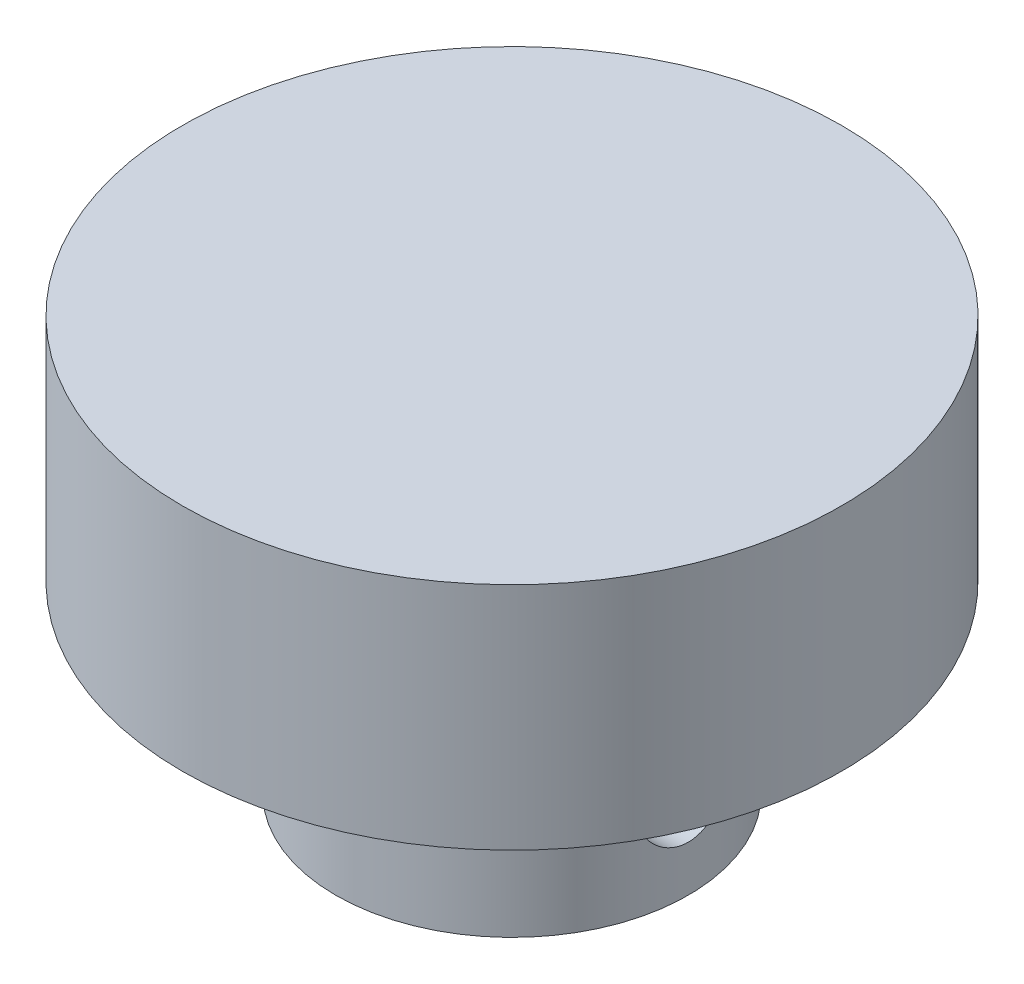
ISO-10303-21;
HEADER;
FILE_DESCRIPTION(('STEP AP214'),'2;1');
FILE_NAME('part.step','',(''),(''),'','','');
FILE_SCHEMA(('AUTOMOTIVE_DESIGN { 1 0 10303 214 1 1 1 1 }'));
ENDSEC;
DATA;
#1=APPLICATION_CONTEXT('core data for automotive mechanical design processes');
#2=APPLICATION_PROTOCOL_DEFINITION('international standard','automotive_design',2000,#1);
#3=PRODUCT_CONTEXT('',#1,'mechanical');
#4=PRODUCT('Part','Part','',(#3));
#5=PRODUCT_RELATED_PRODUCT_CATEGORY('part','',(#4));
#6=PRODUCT_DEFINITION_FORMATION('','',#4);
#7=PRODUCT_DEFINITION_CONTEXT('part definition',#1,'design');
#8=PRODUCT_DEFINITION('design','',#6,#7);
#9=PRODUCT_DEFINITION_SHAPE('','',#8);
#10=(LENGTH_UNIT() NAMED_UNIT(*) SI_UNIT(.MILLI.,.METRE.));
#11=(NAMED_UNIT(*) PLANE_ANGLE_UNIT() SI_UNIT($,.RADIAN.));
#12=(NAMED_UNIT(*) SI_UNIT($,.STERADIAN.) SOLID_ANGLE_UNIT());
#13=UNCERTAINTY_MEASURE_WITH_UNIT(LENGTH_MEASURE(1.E-05),#10,'distance_accuracy_value','');
#14=(GEOMETRIC_REPRESENTATION_CONTEXT(3) GLOBAL_UNCERTAINTY_ASSIGNED_CONTEXT((#13)) GLOBAL_UNIT_ASSIGNED_CONTEXT((#10,
#11,#12)) REPRESENTATION_CONTEXT('',''));
#15=CARTESIAN_POINT('',(0.,0.,0.));
#16=DIRECTION('',(0.,0.,1.));
#17=DIRECTION('',(1.,0.,0.));
#18=AXIS2_PLACEMENT_3D('',#15,#16,#17);
#19=CARTESIAN_POINT('',(0.,0.,0.));
#20=DIRECTION('',(0.,-1.,0.));
#21=DIRECTION('',(0.,0.,-1.));
#22=AXIS2_PLACEMENT_3D('',#19,#20,#21);
#23=CYLINDRICAL_SURFACE('',#22,2.);
#24=CARTESIAN_POINT('',(0.,-27.,0.));
#25=DIRECTION('',(0.,-1.,0.));
#26=DIRECTION('',(0.,0.,-1.));
#27=AXIS2_PLACEMENT_3D('',#24,#25,#26);
#28=CIRCLE('',#27,2.);
#29=CARTESIAN_POINT('',(0.,-27.,-2.));
#30=VERTEX_POINT('',#29);
#31=EDGE_CURVE('E55',#30,#30,#28,.T.);
#32=ORIENTED_EDGE('',*,*,#31,.T.);
#33=EDGE_LOOP('',(#32));
#34=FACE_BOUND('',#33,.T.);
#35=CARTESIAN_POINT('',(0.,-23.2360679774998,-2.));
#36=CARTESIAN_POINT('',(-0.0976283108686207,-23.2360775346282,-1.99999453997731));
#37=CARTESIAN_POINT('',(-0.195290753708801,-23.2425807104744,-1.99278992503664));
#38=CARTESIAN_POINT('',(-0.387119911650814,-23.2673197250162,-1.96458268317731));
#39=CARTESIAN_POINT('',(-0.481280035529566,-23.2855766081271,-1.94355530587862));
#40=CARTESIAN_POINT('',(-0.662735441877684,-23.3305658582557,-1.88935861676632));
#41=CARTESIAN_POINT('',(-0.750087696737658,-23.357215617946,-1.85630718014214));
#42=CARTESIAN_POINT('',(-0.917865832346665,-23.4158409468183,-1.77934008393538));
#43=CARTESIAN_POINT('',(-0.998290269976474,-23.4478176215883,-1.73542216812163));
#44=CARTESIAN_POINT('',(-1.16364688761691,-23.5194607293203,-1.63002410007714));
#45=CARTESIAN_POINT('',(-1.2473321177172,-23.5595493609036,-1.56687435451732));
#46=CARTESIAN_POINT('',(-1.40400270887428,-23.6394482730808,-1.4281921974068));
#47=CARTESIAN_POINT('',(-1.47697752165853,-23.6792582429799,-1.3526477317708));
#48=CARTESIAN_POINT('',(-1.62064365878166,-23.7608881852375,-1.17815690494295));
#49=CARTESIAN_POINT('',(-1.68948251177567,-23.8021678584692,-1.07740643965819));
#50=CARTESIAN_POINT('',(-1.80864209549007,-23.8755848448276,-0.862470964212231));
#51=CARTESIAN_POINT('',(-1.85898351403119,-23.9077323623104,-0.748301152321702));
#52=CARTESIAN_POINT('',(-1.93355640101745,-23.9559990746473,-0.523249073480001));
#53=CARTESIAN_POINT('',(-1.96008334449556,-23.9735117561587,-0.413434725181415));
#54=CARTESIAN_POINT('',(-1.99418448928365,-23.9960974546192,-0.189695448729861));
#55=CARTESIAN_POINT('',(-2.00178255922544,-24.0011861376236,-0.0757758812858242));
#56=CARTESIAN_POINT('',(-1.99782755005095,-23.9985536172295,0.13414705023233));
#57=CARTESIAN_POINT('',(-1.98901094868294,-23.9926626491013,0.230240638008753));
#58=CARTESIAN_POINT('',(-1.95790894864109,-23.9720818279002,0.419238633271016));
#59=CARTESIAN_POINT('',(-1.93562256769646,-23.957391333131,0.512142807649725));
#60=CARTESIAN_POINT('',(-1.87880431520542,-23.9205209170374,0.692077937671169));
#61=CARTESIAN_POINT('',(-1.84432111480144,-23.8983707798268,0.779130623845962));
#62=CARTESIAN_POINT('',(-1.76444635704718,-23.8482110447629,0.946209150653556));
#63=CARTESIAN_POINT('',(-1.71905280849849,-23.8202003774516,1.0262337049694));
#64=CARTESIAN_POINT('',(-1.61202126254011,-23.756180584507,1.18828429196344));
#65=CARTESIAN_POINT('',(-1.54903247664721,-23.7196040879203,1.26919148099708));
#66=CARTESIAN_POINT('',(-1.41210132051968,-23.64400601827,1.41998807498305));
#67=CARTESIAN_POINT('',(-1.33814205406619,-23.6049807281523,1.48986013519457));
#68=CARTESIAN_POINT('',(-1.16803678978671,-23.5215004494415,1.62772235326165));
#69=CARTESIAN_POINT('',(-1.07022892028551,-23.4771432000893,1.69373593126354));
#70=CARTESIAN_POINT('',(-0.862490160779287,-23.394756108311,1.80834874945482));
#71=CARTESIAN_POINT('',(-0.752580005586102,-23.3567157153489,1.85697718654898));
#72=CARTESIAN_POINT('',(-0.555280937926897,-23.3026287030689,1.92332724567776));
#73=CARTESIAN_POINT('',(-0.470406629943125,-23.2834036457767,1.94590791747533));
#74=CARTESIAN_POINT('',(-0.296960510183161,-23.2540903978961,1.97979555580014));
#75=CARTESIAN_POINT('',(-0.20839538882738,-23.2439863678235,1.99112206964395));
#76=CARTESIAN_POINT('',(-0.0295570135585047,-23.2344755698737,2.00179400148877));
#77=CARTESIAN_POINT('',(0.0607219785201243,-23.2351153386647,2.00108729753098));
#78=CARTESIAN_POINT('',(0.239683833955045,-23.2470988036895,1.98761629716365));
#79=CARTESIAN_POINT('',(0.328365344107386,-23.2584511764885,1.97484222690381));
#80=CARTESIAN_POINT('',(0.49738941754984,-23.2892797750075,1.93899811187046));
#81=CARTESIAN_POINT('',(0.577927709002579,-23.3083318706975,1.91646174529973));
#82=CARTESIAN_POINT('',(0.734126236050299,-23.3522995853365,1.86223041628513));
#83=CARTESIAN_POINT('',(0.809784822963014,-23.3772171729463,1.83053237805351));
#84=CARTESIAN_POINT('',(0.970202003847521,-23.4361148359619,1.75163346599563));
#85=CARTESIAN_POINT('',(1.0537568115427,-23.4709108143432,1.70260028818246));
#86=CARTESIAN_POINT('',(1.21241680261729,-23.5426251480663,1.59352731501438));
#87=CARTESIAN_POINT('',(1.28751151674245,-23.5795460494754,1.53347411883827));
#88=CARTESIAN_POINT('',(1.44396234746754,-23.6607567832101,1.38876657712435));
#89=CARTESIAN_POINT('',(1.52310284824832,-23.7048945213857,1.30160386514207));
#90=CARTESIAN_POINT('',(1.66581668294029,-23.7877558184164,1.11309948866219));
#91=CARTESIAN_POINT('',(1.72940377125673,-23.8264841478946,1.011770477457));
#92=CARTESIAN_POINT('',(1.82789173891759,-23.8879082124222,0.817487474821795));
#93=CARTESIAN_POINT('',(1.86595650444037,-23.9122545811101,0.726662364886319));
#94=CARTESIAN_POINT('',(1.92860719432044,-23.9527870786704,0.538757079020513));
#95=CARTESIAN_POINT('',(1.95320450285977,-23.9689800987199,0.441682263858768));
#96=CARTESIAN_POINT('',(1.98769696383875,-23.9917836402675,0.243369392303442));
#97=CARTESIAN_POINT('',(1.99752667950668,-23.9983515085653,0.142114836924317));
#98=CARTESIAN_POINT('',(2.0016478514171,-24.0010982102906,-0.0608555465807332));
#99=CARTESIAN_POINT('',(1.99594075195618,-23.997278009389,-0.162571330953449));
#100=CARTESIAN_POINT('',(1.9703405109953,-23.9802955597732,-0.355757532528106));
#101=CARTESIAN_POINT('',(1.95150901513819,-23.9678327720986,-0.44743514307053));
#102=CARTESIAN_POINT('',(1.9017619905691,-23.9353610620693,-0.626018422997062));
#103=CARTESIAN_POINT('',(1.87084458465274,-23.915350967471,-0.71292334868689));
#104=CARTESIAN_POINT('',(1.79606129511597,-23.8679176548619,-0.885147296608352));
#105=CARTESIAN_POINT('',(1.75154969250492,-23.8401324894634,-0.970083589200266));
#106=CARTESIAN_POINT('',(1.65184935537401,-23.7797540823547,-1.13155266268318));
#107=CARTESIAN_POINT('',(1.596654232048,-23.7471579664526,-1.20808037205002));
#108=CARTESIAN_POINT('',(1.46737109766369,-23.6739293147239,-1.36329422201402));
#109=CARTESIAN_POINT('',(1.39167697632596,-23.6328391387737,-1.44042679526091));
#110=CARTESIAN_POINT('',(1.22888645845416,-23.5505335764949,-1.58160022281596));
#111=CARTESIAN_POINT('',(1.14178161116591,-23.5093181197015,-1.64563128323923));
#112=CARTESIAN_POINT('',(0.964132409244706,-23.433842135903,-1.75513253518411));
#113=CARTESIAN_POINT('',(0.874358190049655,-23.399290867419,-1.8016464689721));
#114=CARTESIAN_POINT('',(0.686715551006839,-23.3374750159102,-1.88115802340272));
#115=CARTESIAN_POINT('',(0.588863306137845,-23.310196312953,-1.91418190281333));
#116=CARTESIAN_POINT('',(0.409228531575449,-23.2719105192954,-1.95936262470908));
#117=CARTESIAN_POINT('',(0.3286917632097,-23.2586369541015,-1.97452228373248));
#118=CARTESIAN_POINT('',(0.165443599495461,-23.2407151921601,-1.99483915818926));
#119=CARTESIAN_POINT('',(0.0827340557394213,-23.2360598784148,-2.00000462703715));
#120=CARTESIAN_POINT('',(0.,-23.2360679774998,-2.));
#121=B_SPLINE_CURVE_WITH_KNOTS('',3,(#35,#36,#37,#38,#39,#40,#41,#42,#43,#44,#45,#46,#47,#48,
#49,#50,#51,#52,#53,#54,#55,#56,#57,#58,#59,#60,#61,#62,#63,#64,#65,#66,#67,#68,#69,#70,#71,#72,
#73,#74,#75,#76,#77,#78,#79,#80,#81,#82,#83,#84,#85,#86,#87,#88,#89,#90,#91,#92,#93,#94,#95,#96,
#97,#98,#99,#100,#101,#102,#103,#104,#105,#106,#107,#108,#109,#110,#111,#112,#113,#114,#115,
#116,#117,#118,#119,#120),.UNSPECIFIED.,.T.,.F.,(4,2,2,2,2,2,2,2,2,2,2,2,2,2,2,2,2,2,2,2,2,2,2,
2,2,2,2,2,2,2,2,2,2,2,2,2,2,2,2,2,2,2,4),(0.,0.292506930722153,0.585539042259288,
0.875772651216275,1.16606657266549,1.50154677068638,1.83735518436275,2.22167031006289,
2.6055542938858,2.9463748206358,3.28676536688298,3.57539534955742,3.86404638283746,
4.15155831973191,4.43912276903,4.76447525946635,5.09033414796638,5.46678703504944,
5.84260469743948,6.11126090401324,6.37944966235486,6.64880037638036,6.91836943570598,
7.17476451706936,7.43124577644957,7.73899230052352,8.04711556801509,8.42254684520963,
8.7976449057258,9.10070580611698,9.40351012888472,9.70765229266164,10.0117661844615,
10.2937678224973,10.5758132789284,10.874178629859,11.1727229593109,11.5182220628451,
11.863978504186,12.1833412579672,12.5020793664923,12.7501661630426,12.9980479966543),.UNSPECIFIED.);
#122=CARTESIAN_POINT('',(0.,-23.2360679774998,-2.));
#123=VERTEX_POINT('',#122);
#124=EDGE_CURVE('E84',#123,#123,#121,.T.);
#125=ORIENTED_EDGE('',*,*,#124,.T.);
#126=EDGE_LOOP('',(#125));
#127=FACE_BOUND('',#126,.T.);
#128=ADVANCED_FACE('F42',(#34,#127),#23,.F.);
#129=CARTESIAN_POINT('',(0.,0.,0.));
#130=DIRECTION('',(0.,-1.,0.));
#131=DIRECTION('',(0.,0.,-1.));
#132=AXIS2_PLACEMENT_3D('',#129,#130,#131);
#133=CYLINDRICAL_SURFACE('',#132,11.5);
#134=CARTESIAN_POINT('',(-11.1018016555873,-21.,3.));
#135=CARTESIAN_POINT('',(-11.1018046416681,-21.1654050237616,2.99999574781901));
#136=CARTESIAN_POINT('',(-11.1055385888146,-21.3308557545628,2.9862739870282));
#137=CARTESIAN_POINT('',(-11.1200285885836,-21.6569885718273,2.93184764187599));
#138=CARTESIAN_POINT('',(-11.1307883626702,-21.8176680838725,2.89112875740957));
#139=CARTESIAN_POINT('',(-11.1580303325578,-22.1294936470709,2.78412993626242));
#140=CARTESIAN_POINT('',(-11.1745047138183,-22.2806523857462,2.71788489213753));
#141=CARTESIAN_POINT('',(-11.2113097714373,-22.5697318285177,2.56182247025821));
#142=CARTESIAN_POINT('',(-11.2316406997192,-22.7076516669154,2.47200355242808));
#143=CARTESIAN_POINT('',(-11.2744133805517,-22.9696406800769,2.26904416505215));
#144=CARTESIAN_POINT('',(-11.2968912629679,-23.0933459843836,2.15544151418971));
#145=CARTESIAN_POINT('',(-11.3411127618239,-23.3201816553928,1.90913395855516));
#146=CARTESIAN_POINT('',(-11.3628563046717,-23.4233099650166,1.77642714622373));
#147=CARTESIAN_POINT('',(-11.4035611707643,-23.6075713950247,1.49316595449653));
#148=CARTESIAN_POINT('',(-11.4224748964669,-23.6883442880935,1.34236981412251));
#149=CARTESIAN_POINT('',(-11.4549753491794,-23.8232552734816,1.02876288500976));
#150=CARTESIAN_POINT('',(-11.4685629343453,-23.8773976569088,0.865954036804427));
#151=CARTESIAN_POINT('',(-11.4886247015949,-23.9563373821463,0.536739673077931));
#152=CARTESIAN_POINT('',(-11.4952486120864,-23.9817533234142,0.3704917699844));
#153=CARTESIAN_POINT('',(-11.5011595838329,-24.0044633374111,0.0359686742163259));
#154=CARTESIAN_POINT('',(-11.5004478222506,-24.0017619221602,-0.132306188861164));
#155=CARTESIAN_POINT('',(-11.4918779731592,-23.9687528229509,-0.461806253219182));
#156=CARTESIAN_POINT('',(-11.484192846204,-23.9391132578422,-0.623103567895696));
#157=CARTESIAN_POINT('',(-11.4627429057779,-23.8541466535866,-0.938350753963736));
#158=CARTESIAN_POINT('',(-11.4489777533824,-23.7988181824302,-1.09230021522682));
#159=CARTESIAN_POINT('',(-11.4166550310123,-23.6635222211075,-1.39020655404972));
#160=CARTESIAN_POINT('',(-11.3980526058452,-23.5833226884191,-1.53405298132852));
#161=CARTESIAN_POINT('',(-11.3580645092186,-23.4007385214412,-1.80647599780597));
#162=CARTESIAN_POINT('',(-11.3366783159438,-23.2983497253925,-1.93504971548291));
#163=CARTESIAN_POINT('',(-11.2927027234436,-23.0707342925104,-2.17726444915333));
#164=CARTESIAN_POINT('',(-11.2700964360244,-22.9449245109508,-2.29035502483112));
#165=CARTESIAN_POINT('',(-11.2267989241084,-22.6758904297271,-2.49396302118491));
#166=CARTESIAN_POINT('',(-11.2061078062925,-22.5326651609932,-2.58447918487123));
#167=CARTESIAN_POINT('',(-11.1689181104159,-22.2317127155353,-2.74076407552189));
#168=CARTESIAN_POINT('',(-11.1524440176527,-22.0739077767657,-2.80638929275415));
#169=CARTESIAN_POINT('',(-11.1258611172957,-21.7489689659287,-2.91000121073618));
#170=CARTESIAN_POINT('',(-11.1157508088869,-21.5818373035765,-2.94799442845877));
#171=CARTESIAN_POINT('',(-11.1033582796576,-21.2481218905076,-2.99432763672089));
#172=CARTESIAN_POINT('',(-11.1008600430728,-21.0816596771591,-3.00348615748074));
#173=CARTESIAN_POINT('',(-11.1033845712935,-20.7495834093271,-2.99414013174871));
#174=CARTESIAN_POINT('',(-11.1084065745196,-20.5839692706626,-2.97563838642951));
#175=CARTESIAN_POINT('',(-11.1251976544441,-20.2614033119794,-2.91221727119861));
#176=CARTESIAN_POINT('',(-11.1368423739405,-20.1043487349835,-2.86778442782072));
#177=CARTESIAN_POINT('',(-11.1654465443306,-19.7999196581102,-2.75430673419544));
#178=CARTESIAN_POINT('',(-11.1824066668623,-19.6525463843807,-2.68525877350583));
#179=CARTESIAN_POINT('',(-11.2201780868576,-19.3682232606417,-2.52283092439208));
#180=CARTESIAN_POINT('',(-11.241063253276,-19.2315598066974,-2.42896728020135));
#181=CARTESIAN_POINT('',(-11.2841551264166,-18.9756228948465,-2.22017639835021));
#182=CARTESIAN_POINT('',(-11.3063620699895,-18.8563525669245,-2.10524537788259));
#183=CARTESIAN_POINT('',(-11.3503349067264,-18.6352188967519,-1.85380657439176));
#184=CARTESIAN_POINT('',(-11.3720718556128,-18.5339247531388,-1.71679215074347));
#185=CARTESIAN_POINT('',(-11.4120266295759,-18.3557774302615,-1.42722696916738));
#186=CARTESIAN_POINT('',(-11.4302446412716,-18.278922954754,-1.27467703578644));
#187=CARTESIAN_POINT('',(-11.4609920323941,-18.1525299824902,-0.959441437408471));
#188=CARTESIAN_POINT('',(-11.4735633090077,-18.1027896962873,-0.796840961860024));
#189=CARTESIAN_POINT('',(-11.491784860586,-18.0314438116452,-0.465214293018002));
#190=CARTESIAN_POINT('',(-11.4974365985569,-18.0098322658524,-0.296189465827482));
#191=CARTESIAN_POINT('',(-11.501116503245,-17.9957165312222,0.0381598942663429));
#192=CARTESIAN_POINT('',(-11.4993638178306,-18.0023756479901,0.203447203040741));
#193=CARTESIAN_POINT('',(-11.4889239903936,-18.0426788146342,0.530462632714367));
#194=CARTESIAN_POINT('',(-11.4802370890226,-18.0763219280328,0.692190876930534));
#195=CARTESIAN_POINT('',(-11.456945044609,-18.1691733555065,1.00653701523352));
#196=CARTESIAN_POINT('',(-11.4423777301083,-18.2282184162209,1.15920611864885));
#197=CARTESIAN_POINT('',(-11.4088517835094,-18.3700512800702,1.45255760125081));
#198=CARTESIAN_POINT('',(-11.3898925567045,-18.4528422989956,1.59323835356859));
#199=CARTESIAN_POINT('',(-11.3490080955884,-18.6423022120024,1.86254087988201));
#200=CARTESIAN_POINT('',(-11.3270191162386,-18.7495304891059,1.99075942238901));
#201=CARTESIAN_POINT('',(-11.282821318698,-18.9837512779054,2.22766629387465));
#202=CARTESIAN_POINT('',(-11.2606124449277,-19.1107489123454,2.33634954498916));
#203=CARTESIAN_POINT('',(-11.2179598882197,-19.3840805190096,2.53333126849171));
#204=CARTESIAN_POINT('',(-11.1975624999878,-19.5307615875036,2.62115899195099));
#205=CARTESIAN_POINT('',(-11.1614846462572,-19.8373209755387,2.77078042280792));
#206=CARTESIAN_POINT('',(-11.1458009729192,-19.9971902252286,2.83259184668349));
#207=CARTESIAN_POINT('',(-11.1232017724301,-20.2971525728509,2.91993765526439));
#208=CARTESIAN_POINT('',(-11.1152400200808,-20.4358956508644,2.9498923670659));
#209=CARTESIAN_POINT('',(-11.1045389509216,-20.7164148299402,2.98992433717078));
#210=CARTESIAN_POINT('',(-11.101799095482,-20.8581906166581,3.00000364559159));
#211=CARTESIAN_POINT('',(-11.1018016555873,-21.,3.));
#212=B_SPLINE_CURVE_WITH_KNOTS('',3,(#134,#135,#136,#137,#138,#139,#140,#141,#142,#143,#144,
#145,#146,#147,#148,#149,#150,#151,#152,#153,#154,#155,#156,#157,#158,#159,#160,#161,#162,#163,
#164,#165,#166,#167,#168,#169,#170,#171,#172,#173,#174,#175,#176,#177,#178,#179,#180,#181,#182,
#183,#184,#185,#186,#187,#188,#189,#190,#191,#192,#193,#194,#195,#196,#197,#198,#199,#200,#201,
#202,#203,#204,#205,#206,#207,#208,#209,#210,#211),.UNSPECIFIED.,.T.,.F.,(4,2,2,2,2,2,2,2,2,2,2,
2,2,2,2,2,2,2,2,2,2,2,2,2,2,2,2,2,2,2,2,2,2,2,2,2,2,2,4),(0.,0.495693864426937,
0.991650502901441,1.4869315930392,1.98224504783315,2.4882659798999,2.99433747348055,
3.5081429991003,4.0218657055059,4.52430149755158,5.02665666447218,5.51688263581214,
6.00713593772637,6.50210829427883,6.99717356700053,7.50680002907636,8.0164548618693,
8.52900500910673,9.04143423279153,9.53917954400053,10.0368744516405,10.5255187110587,
11.0142247389737,11.5132674061231,12.0123997681006,12.5252646912173,13.0381024082112,
13.5470694807036,14.0559289230968,14.5498348761799,15.0437236890362,15.5344847111833,
16.0253122259277,16.528764120949,17.0323466910099,17.5463982140932,18.0600991117908,
18.4851242500374,18.9101055452975),.UNSPECIFIED.);
#213=CARTESIAN_POINT('',(-11.1018016555873,-21.,3.));
#214=VERTEX_POINT('',#213);
#215=EDGE_CURVE('E63',#214,#214,#212,.T.);
#216=ORIENTED_EDGE('',*,*,#215,.T.);
#217=EDGE_LOOP('',(#216));
#218=FACE_BOUND('',#217,.T.);
#219=CARTESIAN_POINT('',(0.,-15.,0.));
#220=DIRECTION('',(0.,-1.,0.));
#221=DIRECTION('',(0.,0.,-1.));
#222=AXIS2_PLACEMENT_3D('',#219,#220,#221);
#223=CIRCLE('',#222,11.5);
#224=CARTESIAN_POINT('',(0.,-15.,-11.5));
#225=VERTEX_POINT('',#224);
#226=EDGE_CURVE('E129',#225,#225,#223,.T.);
#227=ORIENTED_EDGE('',*,*,#226,.T.);
#228=EDGE_LOOP('',(#227));
#229=FACE_BOUND('',#228,.T.);
#230=CARTESIAN_POINT('',(0.,-27.,0.));
#231=DIRECTION('',(0.,-1.,0.));
#232=DIRECTION('',(0.,0.,-1.));
#233=AXIS2_PLACEMENT_3D('',#230,#231,#232);
#234=CIRCLE('',#233,11.5);
#235=CARTESIAN_POINT('',(0.,-27.,-11.5));
#236=VERTEX_POINT('',#235);
#237=EDGE_CURVE('E60',#236,#236,#234,.T.);
#238=ORIENTED_EDGE('',*,*,#237,.F.);
#239=EDGE_LOOP('',(#238));
#240=FACE_BOUND('',#239,.T.);
#241=CARTESIAN_POINT('',(11.1018016555873,-21.,3.));
#242=CARTESIAN_POINT('',(11.1018046416681,-20.8345949762384,2.99999574781901));
#243=CARTESIAN_POINT('',(11.1055385888146,-20.6691442454372,2.9862739870282));
#244=CARTESIAN_POINT('',(11.1200285885836,-20.3430114281727,2.93184764187599));
#245=CARTESIAN_POINT('',(11.1307883626702,-20.1823319161275,2.89112875740957));
#246=CARTESIAN_POINT('',(11.1580303325578,-19.8705063529291,2.78412993626242));
#247=CARTESIAN_POINT('',(11.1745047138183,-19.7193476142538,2.71788489213753));
#248=CARTESIAN_POINT('',(11.2113097714373,-19.4302681714823,2.56182247025821));
#249=CARTESIAN_POINT('',(11.2316406997192,-19.2923483330846,2.47200355242808));
#250=CARTESIAN_POINT('',(11.2744133805517,-19.0303593199231,2.26904416505215));
#251=CARTESIAN_POINT('',(11.2968912629679,-18.9066540156165,2.15544151418971));
#252=CARTESIAN_POINT('',(11.3411127618239,-18.6798183446072,1.90913395855516));
#253=CARTESIAN_POINT('',(11.3628563046717,-18.5766900349835,1.77642714622373));
#254=CARTESIAN_POINT('',(11.4035611707643,-18.3924286049753,1.49316595449653));
#255=CARTESIAN_POINT('',(11.4224748964669,-18.3116557119065,1.34236981412251));
#256=CARTESIAN_POINT('',(11.4549753491794,-18.1767447265184,1.02876288500976));
#257=CARTESIAN_POINT('',(11.4685629343453,-18.1226023430912,0.865954036804427));
#258=CARTESIAN_POINT('',(11.4886247015949,-18.0436626178537,0.536739673077931));
#259=CARTESIAN_POINT('',(11.4952486120864,-18.0182466765859,0.3704917699844));
#260=CARTESIAN_POINT('',(11.5011595838329,-17.9955366625889,0.0359686742163259));
#261=CARTESIAN_POINT('',(11.5004478222506,-17.9982380778398,-0.132306188861164));
#262=CARTESIAN_POINT('',(11.4918779731592,-18.0312471770491,-0.461806253219182));
#263=CARTESIAN_POINT('',(11.484192846204,-18.0608867421578,-0.623103567895696));
#264=CARTESIAN_POINT('',(11.4627429057779,-18.1458533464134,-0.938350753963736));
#265=CARTESIAN_POINT('',(11.4489777533824,-18.2011818175698,-1.09230021522682));
#266=CARTESIAN_POINT('',(11.4166550310123,-18.3364777788925,-1.39020655404972));
#267=CARTESIAN_POINT('',(11.3980526058452,-18.4166773115809,-1.53405298132852));
#268=CARTESIAN_POINT('',(11.3580645092186,-18.5992614785589,-1.80647599780597));
#269=CARTESIAN_POINT('',(11.3366783159438,-18.7016502746076,-1.93504971548291));
#270=CARTESIAN_POINT('',(11.2927027234436,-18.9292657074896,-2.17726444915333));
#271=CARTESIAN_POINT('',(11.2700964360244,-19.0550754890492,-2.29035502483112));
#272=CARTESIAN_POINT('',(11.2267989241084,-19.3241095702729,-2.49396302118491));
#273=CARTESIAN_POINT('',(11.2061078062925,-19.4673348390068,-2.58447918487123));
#274=CARTESIAN_POINT('',(11.1689181104159,-19.7682872844647,-2.74076407552189));
#275=CARTESIAN_POINT('',(11.1524440176527,-19.9260922232343,-2.80638929275416));
#276=CARTESIAN_POINT('',(11.1258611172957,-20.2510310340713,-2.91000121073618));
#277=CARTESIAN_POINT('',(11.1157508088869,-20.4181626964235,-2.94799442845877));
#278=CARTESIAN_POINT('',(11.1033582796576,-20.7518781094924,-2.99432763672089));
#279=CARTESIAN_POINT('',(11.1008600430728,-20.9183403228409,-3.00348615748074));
#280=CARTESIAN_POINT('',(11.1033845712935,-21.250416590673,-2.99414013174871));
#281=CARTESIAN_POINT('',(11.1084065745196,-21.4160307293374,-2.97563838642951));
#282=CARTESIAN_POINT('',(11.1251976544441,-21.7385966880206,-2.91221727119861));
#283=CARTESIAN_POINT('',(11.1368423739405,-21.8956512650165,-2.86778442782072));
#284=CARTESIAN_POINT('',(11.1654465443306,-22.2000803418898,-2.75430673419544));
#285=CARTESIAN_POINT('',(11.1824066668623,-22.3474536156193,-2.68525877350583));
#286=CARTESIAN_POINT('',(11.2201780868576,-22.6317767393583,-2.52283092439208));
#287=CARTESIAN_POINT('',(11.241063253276,-22.7684401933026,-2.42896728020135));
#288=CARTESIAN_POINT('',(11.2841551264166,-23.0243771051535,-2.22017639835021));
#289=CARTESIAN_POINT('',(11.3063620699895,-23.1436474330755,-2.10524537788259));
#290=CARTESIAN_POINT('',(11.3503349067264,-23.3647811032481,-1.85380657439176));
#291=CARTESIAN_POINT('',(11.3720718556128,-23.4660752468612,-1.71679215074347));
#292=CARTESIAN_POINT('',(11.4120266295759,-23.6442225697385,-1.42722696916738));
#293=CARTESIAN_POINT('',(11.4302446412716,-23.721077045246,-1.27467703578644));
#294=CARTESIAN_POINT('',(11.4609920323941,-23.8474700175098,-0.959441437408471));
#295=CARTESIAN_POINT('',(11.4735633090077,-23.8972103037127,-0.796840961860024));
#296=CARTESIAN_POINT('',(11.491784860586,-23.9685561883548,-0.465214293018002));
#297=CARTESIAN_POINT('',(11.4974365985569,-23.9901677341476,-0.296189465827482));
#298=CARTESIAN_POINT('',(11.501116503245,-24.0042834687778,0.0381598942663429));
#299=CARTESIAN_POINT('',(11.4993638178306,-23.9976243520099,0.203447203040741));
#300=CARTESIAN_POINT('',(11.4889239903936,-23.9573211853658,0.530462632714367));
#301=CARTESIAN_POINT('',(11.4802370890226,-23.9236780719672,0.692190876930534));
#302=CARTESIAN_POINT('',(11.456945044609,-23.8308266444935,1.00653701523352));
#303=CARTESIAN_POINT('',(11.4423777301083,-23.7717815837791,1.15920611864885));
#304=CARTESIAN_POINT('',(11.4088517835094,-23.6299487199298,1.45255760125081));
#305=CARTESIAN_POINT('',(11.3898925567045,-23.5471577010044,1.59323835356859));
#306=CARTESIAN_POINT('',(11.3490080955884,-23.3576977879976,1.86254087988201));
#307=CARTESIAN_POINT('',(11.3270191162385,-23.2504695108941,1.99075942238901));
#308=CARTESIAN_POINT('',(11.2828213186979,-23.0162487220946,2.22766629387464));
#309=CARTESIAN_POINT('',(11.2606124449277,-22.8892510876546,2.33634954498916));
#310=CARTESIAN_POINT('',(11.2179598882197,-22.6159194809904,2.53333126849171));
#311=CARTESIAN_POINT('',(11.1975624999878,-22.4692384124964,2.62115899195099));
#312=CARTESIAN_POINT('',(11.1614846462572,-22.1626790244613,2.77078042280792));
#313=CARTESIAN_POINT('',(11.1458009729192,-22.0028097747714,2.83259184668349));
#314=CARTESIAN_POINT('',(11.1232017724301,-21.7028474271491,2.91993765526439));
#315=CARTESIAN_POINT('',(11.1152400200808,-21.5641043491356,2.9498923670659));
#316=CARTESIAN_POINT('',(11.1045389509216,-21.2835851700598,2.98992433717078));
#317=CARTESIAN_POINT('',(11.101799095482,-21.1418093833419,3.00000364559159));
#318=CARTESIAN_POINT('',(11.1018016555873,-21.,3.));
#319=B_SPLINE_CURVE_WITH_KNOTS('',3,(#241,#242,#243,#244,#245,#246,#247,#248,#249,#250,#251,
#252,#253,#254,#255,#256,#257,#258,#259,#260,#261,#262,#263,#264,#265,#266,#267,#268,#269,#270,
#271,#272,#273,#274,#275,#276,#277,#278,#279,#280,#281,#282,#283,#284,#285,#286,#287,#288,#289,
#290,#291,#292,#293,#294,#295,#296,#297,#298,#299,#300,#301,#302,#303,#304,#305,#306,#307,#308,
#309,#310,#311,#312,#313,#314,#315,#316,#317,#318),.UNSPECIFIED.,.T.,.F.,(4,2,2,2,2,2,2,2,2,2,2,
2,2,2,2,2,2,2,2,2,2,2,2,2,2,2,2,2,2,2,2,2,2,2,2,2,2,2,4),(0.,0.495693864426934,
0.991650502901441,1.4869315930392,1.98224504783315,2.4882659798999,2.99433747348055,
3.5081429991003,4.0218657055059,4.52430149755158,5.02665666447218,5.51688263581214,
6.00713593772637,6.50210829427883,6.99717356700053,7.50680002907636,8.0164548618693,
8.52900500910673,9.04143423279153,9.53917954400053,10.0368744516405,10.5255187110587,
11.0142247389737,11.5132674061231,12.0123997681006,12.5252646912173,13.0381024082112,
13.5470694807036,14.0559289230968,14.5498348761799,15.0437236890362,15.5344847111833,
16.0253122259277,16.528764120949,17.0323466910099,17.5463982140932,18.0600991117908,
18.4851242500374,18.9101055452975),.UNSPECIFIED.);
#320=CARTESIAN_POINT('',(11.1018016555873,-21.,3.));
#321=VERTEX_POINT('',#320);
#322=EDGE_CURVE('E46',#321,#321,#319,.T.);
#323=ORIENTED_EDGE('',*,*,#322,.T.);
#324=EDGE_LOOP('',(#323));
#325=FACE_BOUND('',#324,.T.);
#326=ADVANCED_FACE('F68',(#218,#229,#240,#325),#133,.T.);
#327=CARTESIAN_POINT('',(0.,-27.,-11.5));
#328=DIRECTION('',(0.,-1.,0.));
#329=DIRECTION('',(0.,0.,-1.));
#330=AXIS2_PLACEMENT_3D('',#327,#328,#329);
#331=PLANE('',#330);
#332=ORIENTED_EDGE('',*,*,#237,.T.);
#333=EDGE_LOOP('',(#332));
#334=FACE_BOUND('',#333,.T.);
#335=ORIENTED_EDGE('',*,*,#31,.F.);
#336=EDGE_LOOP('',(#335));
#337=FACE_BOUND('',#336,.T.);
#338=ADVANCED_FACE('F98',(#334,#337),#331,.T.);
#339=CARTESIAN_POINT('',(0.,-15.,-21.5));
#340=DIRECTION('',(0.,-1.,0.));
#341=DIRECTION('',(0.,0.,-1.));
#342=AXIS2_PLACEMENT_3D('',#339,#340,#341);
#343=PLANE('',#342);
#344=CARTESIAN_POINT('',(0.,-15.,0.));
#345=DIRECTION('',(0.,-1.,0.));
#346=DIRECTION('',(0.,0.,-1.));
#347=AXIS2_PLACEMENT_3D('',#344,#345,#346);
#348=CIRCLE('',#347,21.5);
#349=CARTESIAN_POINT('',(0.,-15.,-21.5));
#350=VERTEX_POINT('',#349);
#351=EDGE_CURVE('E132',#350,#350,#348,.T.);
#352=ORIENTED_EDGE('',*,*,#351,.T.);
#353=EDGE_LOOP('',(#352));
#354=FACE_BOUND('',#353,.T.);
#355=ORIENTED_EDGE('',*,*,#226,.F.);
#356=EDGE_LOOP('',(#355));
#357=FACE_BOUND('',#356,.T.);
#358=ADVANCED_FACE('F101',(#354,#357),#343,.T.);
#359=CARTESIAN_POINT('',(0.,0.,0.));
#360=DIRECTION('',(0.,-1.,0.));
#361=DIRECTION('',(0.,0.,-1.));
#362=AXIS2_PLACEMENT_3D('',#359,#360,#361);
#363=CYLINDRICAL_SURFACE('',#362,21.5);
#364=CARTESIAN_POINT('',(0.,0.,0.));
#365=DIRECTION('',(0.,-1.,0.));
#366=DIRECTION('',(0.,0.,-1.));
#367=AXIS2_PLACEMENT_3D('',#364,#365,#366);
#368=CIRCLE('',#367,21.5);
#369=CARTESIAN_POINT('',(0.,0.,-21.5));
#370=VERTEX_POINT('',#369);
#371=EDGE_CURVE('E136',#370,#370,#368,.T.);
#372=ORIENTED_EDGE('',*,*,#371,.T.);
#373=EDGE_LOOP('',(#372));
#374=FACE_BOUND('',#373,.T.);
#375=ORIENTED_EDGE('',*,*,#351,.F.);
#376=EDGE_LOOP('',(#375));
#377=FACE_BOUND('',#376,.T.);
#378=ADVANCED_FACE('F107',(#374,#377),#363,.T.);
#379=CARTESIAN_POINT('',(0.,0.,-2.));
#380=DIRECTION('',(0.,1.,0.));
#381=DIRECTION('',(0.,0.,1.));
#382=AXIS2_PLACEMENT_3D('',#379,#380,#381);
#383=PLANE('',#382);
#384=ORIENTED_EDGE('',*,*,#371,.F.);
#385=EDGE_LOOP('',(#384));
#386=FACE_BOUND('',#385,.T.);
#387=ADVANCED_FACE('F76',(#386),#383,.T.);
#388=CARTESIAN_POINT('',(15.,-21.,0.));
#389=DIRECTION('',(-1.,0.,0.));
#390=DIRECTION('',(0.,0.,1.));
#391=AXIS2_PLACEMENT_3D('',#388,#389,#390);
#392=CYLINDRICAL_SURFACE('',#391,3.);
#393=CARTESIAN_POINT('',(0.,-18.7639320225002,-2.));
#394=CARTESIAN_POINT('',(0.0976283108686207,-18.7639224653718,-1.99999453997731));
#395=CARTESIAN_POINT('',(0.195290753708801,-18.7574192895256,-1.99278992503664));
#396=CARTESIAN_POINT('',(0.387119911650814,-18.7326802749838,-1.96458268317731));
#397=CARTESIAN_POINT('',(0.481280035529566,-18.7144233918729,-1.94355530587862));
#398=CARTESIAN_POINT('',(0.662735441877684,-18.6694341417443,-1.88935861676632));
#399=CARTESIAN_POINT('',(0.750087696737658,-18.642784382054,-1.85630718014214));
#400=CARTESIAN_POINT('',(0.917865832346665,-18.5841590531818,-1.77934008393538));
#401=CARTESIAN_POINT('',(0.998290269976474,-18.5521823784117,-1.73542216812163));
#402=CARTESIAN_POINT('',(1.16364688761691,-18.4805392706797,-1.63002410007714));
#403=CARTESIAN_POINT('',(1.2473321177172,-18.4404506390964,-1.56687435451732));
#404=CARTESIAN_POINT('',(1.40400270887428,-18.3605517269192,-1.4281921974068));
#405=CARTESIAN_POINT('',(1.47697752165853,-18.3207417570202,-1.3526477317708));
#406=CARTESIAN_POINT('',(1.62064365878166,-18.2391118147625,-1.17815690494295));
#407=CARTESIAN_POINT('',(1.68948251177567,-18.1978321415308,-1.07740643965819));
#408=CARTESIAN_POINT('',(1.80864209549007,-18.1244151551724,-0.862470964212231));
#409=CARTESIAN_POINT('',(1.85898351403119,-18.0922676376896,-0.748301152321702));
#410=CARTESIAN_POINT('',(1.93355640101745,-18.0440009253528,-0.523249073480001));
#411=CARTESIAN_POINT('',(1.96008334449556,-18.0264882438413,-0.413434725181414));
#412=CARTESIAN_POINT('',(1.99418448928365,-18.0039025453808,-0.189695448729861));
#413=CARTESIAN_POINT('',(2.00178255922544,-17.9988138623764,-0.0757758812858241));
#414=CARTESIAN_POINT('',(1.99782755005095,-18.0014463827705,0.13414705023233));
#415=CARTESIAN_POINT('',(1.98901094868294,-18.0073373508987,0.230240638008753));
#416=CARTESIAN_POINT('',(1.95790894864109,-18.0279181720998,0.419238633271016));
#417=CARTESIAN_POINT('',(1.93562256769646,-18.042608666869,0.512142807649725));
#418=CARTESIAN_POINT('',(1.87880431520542,-18.0794790829626,0.692077937671169));
#419=CARTESIAN_POINT('',(1.84432111480144,-18.1016292201732,0.779130623845962));
#420=CARTESIAN_POINT('',(1.76444635704718,-18.1517889552371,0.946209150653556));
#421=CARTESIAN_POINT('',(1.71905280849849,-18.1797996225484,1.0262337049694));
#422=CARTESIAN_POINT('',(1.61202126254011,-18.243819415493,1.18828429196344));
#423=CARTESIAN_POINT('',(1.54903247664721,-18.2803959120798,1.26919148099708));
#424=CARTESIAN_POINT('',(1.41210132051968,-18.35599398173,1.41998807498305));
#425=CARTESIAN_POINT('',(1.33814205406619,-18.3950192718477,1.48986013519457));
#426=CARTESIAN_POINT('',(1.16803678978671,-18.4784995505585,1.62772235326165));
#427=CARTESIAN_POINT('',(1.07022892028551,-18.5228567999107,1.69373593126354));
#428=CARTESIAN_POINT('',(0.862490160779287,-18.605243891689,1.80834874945482));
#429=CARTESIAN_POINT('',(0.752580005586102,-18.6432842846511,1.85697718654898));
#430=CARTESIAN_POINT('',(0.555280937926897,-18.6973712969311,1.92332724567776));
#431=CARTESIAN_POINT('',(0.470406629943125,-18.7165963542233,1.94590791747533));
#432=CARTESIAN_POINT('',(0.296960510183161,-18.7459096021039,1.97979555580014));
#433=CARTESIAN_POINT('',(0.20839538882738,-18.7560136321765,1.99112206964395));
#434=CARTESIAN_POINT('',(0.0295570135585047,-18.7655244301263,2.00179400148877));
#435=CARTESIAN_POINT('',(-0.0607219785201243,-18.7648846613353,2.00108729753098));
#436=CARTESIAN_POINT('',(-0.239683833955045,-18.7529011963105,1.98761629716365));
#437=CARTESIAN_POINT('',(-0.328365344107386,-18.7415488235115,1.97484222690381));
#438=CARTESIAN_POINT('',(-0.497389417549839,-18.7107202249925,1.93899811187046));
#439=CARTESIAN_POINT('',(-0.577927709002577,-18.6916681293025,1.91646174529973));
#440=CARTESIAN_POINT('',(-0.734126236050298,-18.6477004146635,1.86223041628513));
#441=CARTESIAN_POINT('',(-0.809784822963013,-18.6227828270537,1.83053237805351));
#442=CARTESIAN_POINT('',(-0.97020200384752,-18.5638851640381,1.75163346599563));
#443=CARTESIAN_POINT('',(-1.0537568115427,-18.5290891856568,1.70260028818246));
#444=CARTESIAN_POINT('',(-1.21241680261729,-18.4573748519337,1.59352731501438));
#445=CARTESIAN_POINT('',(-1.28751151674245,-18.4204539505246,1.53347411883827));
#446=CARTESIAN_POINT('',(-1.44396234746754,-18.3392432167899,1.38876657712435));
#447=CARTESIAN_POINT('',(-1.52310284824832,-18.2951054786143,1.30160386514207));
#448=CARTESIAN_POINT('',(-1.66581668294029,-18.2122441815836,1.11309948866219));
#449=CARTESIAN_POINT('',(-1.72940377125673,-18.1735158521054,1.011770477457));
#450=CARTESIAN_POINT('',(-1.82789173891759,-18.1120917875778,0.817487474821795));
#451=CARTESIAN_POINT('',(-1.86595650444037,-18.0877454188899,0.726662364886318));
#452=CARTESIAN_POINT('',(-1.92860719432044,-18.0472129213296,0.538757079020513));
#453=CARTESIAN_POINT('',(-1.95320450285977,-18.0310199012801,0.441682263858768));
#454=CARTESIAN_POINT('',(-1.98769696383875,-18.0082163597325,0.243369392303442));
#455=CARTESIAN_POINT('',(-1.99752667950668,-18.0016484914347,0.142114836924317));
#456=CARTESIAN_POINT('',(-2.0016478514171,-17.9989017897094,-0.0608555465807332));
#457=CARTESIAN_POINT('',(-1.99594075195618,-18.002721990611,-0.162571330953449));
#458=CARTESIAN_POINT('',(-1.9703405109953,-18.0197044402268,-0.355757532528106));
#459=CARTESIAN_POINT('',(-1.95150901513819,-18.0321672279014,-0.44743514307053));
#460=CARTESIAN_POINT('',(-1.9017619905691,-18.0646389379307,-0.626018422997062));
#461=CARTESIAN_POINT('',(-1.87084458465274,-18.084649032529,-0.712923348686891));
#462=CARTESIAN_POINT('',(-1.79606129511597,-18.1320823451381,-0.885147296608352));
#463=CARTESIAN_POINT('',(-1.75154969250492,-18.1598675105366,-0.970083589200266));
#464=CARTESIAN_POINT('',(-1.65184935537401,-18.2202459176453,-1.13155266268318));
#465=CARTESIAN_POINT('',(-1.596654232048,-18.2528420335474,-1.20808037205002));
#466=CARTESIAN_POINT('',(-1.46737109766369,-18.3260706852761,-1.36329422201402));
#467=CARTESIAN_POINT('',(-1.39167697632596,-18.3671608612263,-1.44042679526091));
#468=CARTESIAN_POINT('',(-1.22888645845416,-18.4494664235051,-1.58160022281596));
#469=CARTESIAN_POINT('',(-1.14178161116591,-18.4906818802985,-1.64563128323923));
#470=CARTESIAN_POINT('',(-0.964132409244706,-18.566157864097,-1.75513253518411));
#471=CARTESIAN_POINT('',(-0.874358190049655,-18.600709132581,-1.8016464689721));
#472=CARTESIAN_POINT('',(-0.686715551006839,-18.6625249840898,-1.88115802340272));
#473=CARTESIAN_POINT('',(-0.588863306137845,-18.689803687047,-1.91418190281333));
#474=CARTESIAN_POINT('',(-0.409228531575449,-18.7280894807046,-1.95936262470908));
#475=CARTESIAN_POINT('',(-0.3286917632097,-18.7413630458985,-1.97452228373248));
#476=CARTESIAN_POINT('',(-0.165443599495461,-18.7592848078399,-1.99483915818926));
#477=CARTESIAN_POINT('',(-0.0827340557394213,-18.7639401215853,-2.00000462703715));
#478=CARTESIAN_POINT('',(0.,-18.7639320225002,-2.));
#479=B_SPLINE_CURVE_WITH_KNOTS('',3,(#393,#394,#395,#396,#397,#398,#399,#400,#401,#402,#403,
#404,#405,#406,#407,#408,#409,#410,#411,#412,#413,#414,#415,#416,#417,#418,#419,#420,#421,#422,
#423,#424,#425,#426,#427,#428,#429,#430,#431,#432,#433,#434,#435,#436,#437,#438,#439,#440,#441,
#442,#443,#444,#445,#446,#447,#448,#449,#450,#451,#452,#453,#454,#455,#456,#457,#458,#459,#460,
#461,#462,#463,#464,#465,#466,#467,#468,#469,#470,#471,#472,#473,#474,#475,#476,#477,#478),
.UNSPECIFIED.,.T.,.F.,(4,2,2,2,2,2,2,2,2,2,2,2,2,2,2,2,2,2,2,2,2,2,2,2,2,2,2,2,2,2,2,2,2,2,2,2,
2,2,2,2,2,2,4),(0.,0.292506930722153,0.585539042259288,0.875772651216275,1.16606657266549,
1.50154677068638,1.83735518436275,2.22167031006289,2.6055542938858,2.9463748206358,
3.28676536688298,3.57539534955742,3.86404638283746,4.15155831973191,4.43912276903,
4.76447525946635,5.09033414796638,5.46678703504944,5.84260469743948,6.11126090401324,
6.37944966235486,6.64880037638036,6.91836943570597,7.17476451706936,7.43124577644957,
7.73899230052352,8.04711556801509,8.42254684520963,8.7976449057258,9.10070580611698,
9.40351012888472,9.70765229266164,10.0117661844615,10.2937678224973,10.5758132789284,
10.874178629859,11.1727229593109,11.5182220628451,11.863978504186,12.1833412579672,
12.5020793664923,12.7501661630426,12.9980479966543),.UNSPECIFIED.);
#480=CARTESIAN_POINT('',(0.,-18.7639320225002,-2.));
#481=VERTEX_POINT('',#480);
#482=EDGE_CURVE('E89',#481,#481,#479,.T.);
#483=ORIENTED_EDGE('',*,*,#482,.F.);
#484=EDGE_LOOP('',(#483));
#485=FACE_BOUND('',#484,.T.);
#486=ORIENTED_EDGE('',*,*,#124,.F.);
#487=EDGE_LOOP('',(#486));
#488=FACE_BOUND('',#487,.T.);
#489=ORIENTED_EDGE('',*,*,#322,.F.);
#490=EDGE_LOOP('',(#489));
#491=FACE_BOUND('',#490,.T.);
#492=ORIENTED_EDGE('',*,*,#215,.F.);
#493=EDGE_LOOP('',(#492));
#494=FACE_BOUND('',#493,.T.);
#495=ADVANCED_FACE('F72',(#485,#488,#491,#494),#392,.F.);
#496=CARTESIAN_POINT('',(0.,-15.0000000000216,0.));
#497=DIRECTION('',(0.,-1.,0.));
#498=DIRECTION('',(0.,0.,-1.));
#499=AXIS2_PLACEMENT_3D('',#496,#497,#498);
#500=PLANE('',#499);
#501=CARTESIAN_POINT('',(0.,-15.0000000000216,0.));
#502=DIRECTION('',(0.,-1.,0.));
#503=DIRECTION('',(0.,0.,-1.));
#504=AXIS2_PLACEMENT_3D('',#501,#502,#503);
#505=CIRCLE('',#504,2.);
#506=CARTESIAN_POINT('',(0.,-15.0000000000216,-2.));
#507=VERTEX_POINT('',#506);
#508=EDGE_CURVE('E10',#507,#507,#505,.T.);
#509=ORIENTED_EDGE('',*,*,#508,.T.);
#510=EDGE_LOOP('',(#509));
#511=FACE_BOUND('',#510,.T.);
#512=ADVANCED_FACE('F44',(#511),#500,.T.);
#513=ORIENTED_EDGE('',*,*,#508,.F.);
#514=EDGE_LOOP('',(#513));
#515=FACE_BOUND('',#514,.T.);
#516=ORIENTED_EDGE('',*,*,#482,.T.);
#517=EDGE_LOOP('',(#516));
#518=FACE_BOUND('',#517,.T.);
#519=ADVANCED_FACE('F94',(#515,#518),#23,.F.);
#520=CLOSED_SHELL('',(#128,#326,#338,#358,#378,#387,#495,#512,#519));
#521=MANIFOLD_SOLID_BREP('B2',#520);
#522=ADVANCED_BREP_SHAPE_REPRESENTATION('',(#18,#521),#14);
#523=SHAPE_DEFINITION_REPRESENTATION(#9,#522);
ENDSEC;
END-ISO-10303-21;
